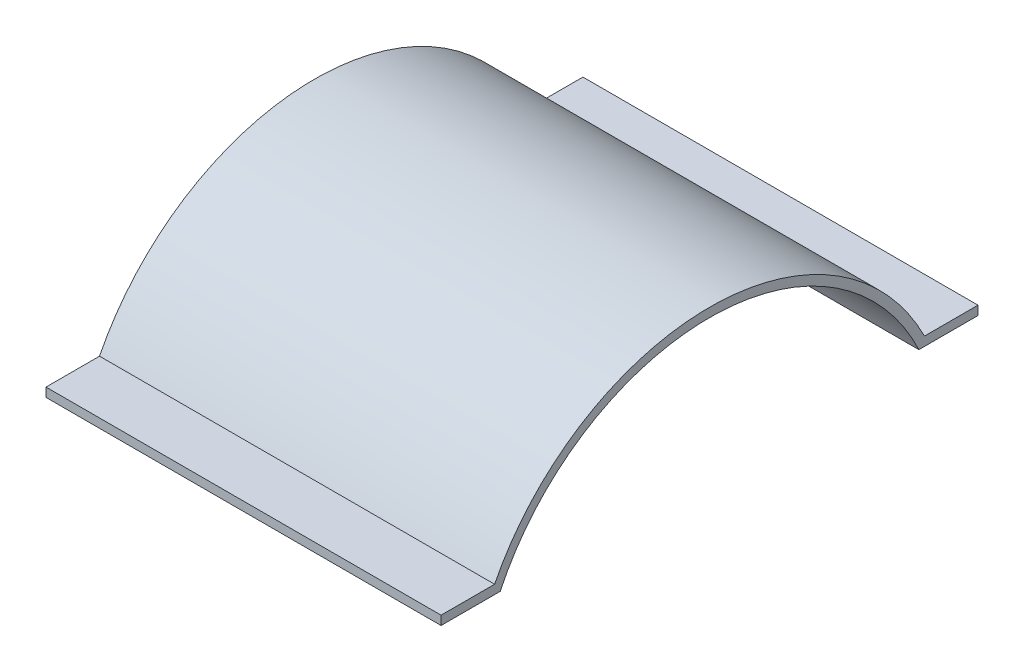
ISO-10303-21;
HEADER;
FILE_DESCRIPTION(('STEP AP214'),'2;1');
FILE_NAME('part.step','',(''),(''),'','','');
FILE_SCHEMA(('AUTOMOTIVE_DESIGN { 1 0 10303 214 1 1 1 1 }'));
ENDSEC;
DATA;
#1=APPLICATION_CONTEXT('core data for automotive mechanical design processes');
#2=APPLICATION_PROTOCOL_DEFINITION('international standard','automotive_design',2000,#1);
#3=PRODUCT_CONTEXT('',#1,'mechanical');
#4=PRODUCT('Part','Part','',(#3));
#5=PRODUCT_RELATED_PRODUCT_CATEGORY('part','',(#4));
#6=PRODUCT_DEFINITION_FORMATION('','',#4);
#7=PRODUCT_DEFINITION_CONTEXT('part definition',#1,'design');
#8=PRODUCT_DEFINITION('design','',#6,#7);
#9=PRODUCT_DEFINITION_SHAPE('','',#8);
#10=(LENGTH_UNIT() NAMED_UNIT(*) SI_UNIT(.MILLI.,.METRE.));
#11=(NAMED_UNIT(*) PLANE_ANGLE_UNIT() SI_UNIT($,.RADIAN.));
#12=(NAMED_UNIT(*) SI_UNIT($,.STERADIAN.) SOLID_ANGLE_UNIT());
#13=UNCERTAINTY_MEASURE_WITH_UNIT(LENGTH_MEASURE(1.E-05),#10,'distance_accuracy_value','');
#14=(GEOMETRIC_REPRESENTATION_CONTEXT(3) GLOBAL_UNCERTAINTY_ASSIGNED_CONTEXT((#13)) GLOBAL_UNIT_ASSIGNED_CONTEXT((#10,
#11,#12)) REPRESENTATION_CONTEXT('',''));
#15=CARTESIAN_POINT('',(0.,0.,0.));
#16=DIRECTION('',(0.,0.,1.));
#17=DIRECTION('',(1.,0.,0.));
#18=AXIS2_PLACEMENT_3D('',#15,#16,#17);
#19=CARTESIAN_POINT('',(44.,-11.05,0.779280478595436));
#20=DIRECTION('',(-1.,0.,0.));
#21=DIRECTION('',(0.,0.,1.));
#22=AXIS2_PLACEMENT_3D('',#19,#20,#21);
#23=CYLINDRICAL_SURFACE('',#22,25.8);
#24=CARTESIAN_POINT('',(0.,-11.05,0.779280478595436));
#25=DIRECTION('',(1.,0.,0.));
#26=DIRECTION('',(0.,0.,-1.));
#27=AXIS2_PLACEMENT_3D('',#24,#25,#26);
#28=CIRCLE('',#27,25.8);
#29=CARTESIAN_POINT('',(0.,0.,-22.5346102305934));
#30=VERTEX_POINT('',#29);
#31=CARTESIAN_POINT('',(0.,0.,24.0931711877842));
#32=VERTEX_POINT('',#31);
#33=EDGE_CURVE('E133',#30,#32,#28,.T.);
#34=ORIENTED_EDGE('',*,*,#33,.F.);
#35=DIRECTION('',(-1.,0.,0.));
#36=VECTOR('',#35,1.);
#37=CARTESIAN_POINT('',(44.,0.,-22.5346102305934));
#38=LINE('',#37,#36);
#39=CARTESIAN_POINT('',(44.,0.,-22.5346102305934));
#40=VERTEX_POINT('',#39);
#41=EDGE_CURVE('E11',#40,#30,#38,.T.);
#42=ORIENTED_EDGE('',*,*,#41,.F.);
#43=CARTESIAN_POINT('',(44.,-11.05,0.779280478595436));
#44=DIRECTION('',(1.,0.,0.));
#45=DIRECTION('',(0.,0.,-1.));
#46=AXIS2_PLACEMENT_3D('',#43,#44,#45);
#47=CIRCLE('',#46,25.8);
#48=CARTESIAN_POINT('',(44.,0.,24.0931711877842));
#49=VERTEX_POINT('',#48);
#50=EDGE_CURVE('E153',#40,#49,#47,.T.);
#51=ORIENTED_EDGE('',*,*,#50,.T.);
#52=DIRECTION('',(-1.,0.,0.));
#53=VECTOR('',#52,1.);
#54=CARTESIAN_POINT('',(44.,0.,24.0931711877842));
#55=LINE('',#54,#53);
#56=EDGE_CURVE('E55',#49,#32,#55,.T.);
#57=ORIENTED_EDGE('',*,*,#56,.T.);
#58=EDGE_LOOP('',(#34,#42,#51,#57));
#59=FACE_BOUND('',#58,.T.);
#60=ADVANCED_FACE('F39',(#59),#23,.F.);
#61=CARTESIAN_POINT('',(44.,0.,0.));
#62=DIRECTION('',(0.,1.,0.));
#63=DIRECTION('',(0.,0.,1.));
#64=AXIS2_PLACEMENT_3D('',#61,#62,#63);
#65=PLANE('',#64);
#66=DIRECTION('',(0.,0.,-1.));
#67=VECTOR('',#66,1.);
#68=CARTESIAN_POINT('',(0.,0.,0.));
#69=LINE('',#68,#67);
#70=CARTESIAN_POINT('',(0.,0.,-29.1207195214046));
#71=VERTEX_POINT('',#70);
#72=EDGE_CURVE('E135',#30,#71,#69,.T.);
#73=ORIENTED_EDGE('',*,*,#72,.T.);
#74=DIRECTION('',(-1.,0.,0.));
#75=VECTOR('',#74,1.);
#76=CARTESIAN_POINT('',(44.,0.,-29.1207195214046));
#77=LINE('',#76,#75);
#78=CARTESIAN_POINT('',(44.,0.,-29.1207195214046));
#79=VERTEX_POINT('',#78);
#80=EDGE_CURVE('E47',#79,#71,#77,.T.);
#81=ORIENTED_EDGE('',*,*,#80,.F.);
#82=DIRECTION('',(0.,0.,-1.));
#83=VECTOR('',#82,1.);
#84=CARTESIAN_POINT('',(44.,0.,0.));
#85=LINE('',#84,#83);
#86=EDGE_CURVE('E178',#40,#79,#85,.T.);
#87=ORIENTED_EDGE('',*,*,#86,.F.);
#88=ORIENTED_EDGE('',*,*,#41,.T.);
#89=EDGE_LOOP('',(#73,#81,#87,#88));
#90=FACE_BOUND('',#89,.T.);
#91=ADVANCED_FACE('F169',(#90),#65,.F.);
#92=CARTESIAN_POINT('',(44.,0.,-29.1207195214046));
#93=DIRECTION('',(0.,0.,-1.));
#94=DIRECTION('',(-1.,0.,0.));
#95=AXIS2_PLACEMENT_3D('',#92,#93,#94);
#96=PLANE('',#95);
#97=DIRECTION('',(0.,-1.,0.));
#98=VECTOR('',#97,1.);
#99=CARTESIAN_POINT('',(0.,0.,-29.1207195214046));
#100=LINE('',#99,#98);
#101=CARTESIAN_POINT('',(0.,1.,-29.1207195214046));
#102=VERTEX_POINT('',#101);
#103=EDGE_CURVE('E138',#102,#71,#100,.T.);
#104=ORIENTED_EDGE('',*,*,#103,.F.);
#105=DIRECTION('',(-1.,0.,0.));
#106=VECTOR('',#105,1.);
#107=CARTESIAN_POINT('',(44.,1.,-29.1207195214046));
#108=LINE('',#107,#106);
#109=CARTESIAN_POINT('',(44.,1.,-29.1207195214046));
#110=VERTEX_POINT('',#109);
#111=EDGE_CURVE('E159',#110,#102,#108,.T.);
#112=ORIENTED_EDGE('',*,*,#111,.F.);
#113=DIRECTION('',(0.,-1.,0.));
#114=VECTOR('',#113,1.);
#115=CARTESIAN_POINT('',(44.,0.,-29.1207195214046));
#116=LINE('',#115,#114);
#117=EDGE_CURVE('E166',#110,#79,#116,.T.);
#118=ORIENTED_EDGE('',*,*,#117,.T.);
#119=ORIENTED_EDGE('',*,*,#80,.T.);
#120=EDGE_LOOP('',(#104,#112,#118,#119));
#121=FACE_BOUND('',#120,.T.);
#122=ADVANCED_FACE('F164',(#121),#96,.T.);
#123=CARTESIAN_POINT('',(44.,1.,0.));
#124=DIRECTION('',(0.,1.,0.));
#125=DIRECTION('',(0.,0.,1.));
#126=AXIS2_PLACEMENT_3D('',#123,#124,#125);
#127=PLANE('',#126);
#128=DIRECTION('',(0.,0.,-1.));
#129=VECTOR('',#128,1.);
#130=CARTESIAN_POINT('',(0.,1.,0.));
#131=LINE('',#130,#129);
#132=CARTESIAN_POINT('',(0.,1.,-23.1589212082481));
#133=VERTEX_POINT('',#132);
#134=EDGE_CURVE('E141',#133,#102,#131,.T.);
#135=ORIENTED_EDGE('',*,*,#134,.F.);
#136=DIRECTION('',(-1.,0.,0.));
#137=VECTOR('',#136,1.);
#138=CARTESIAN_POINT('',(44.,1.,-23.1589212082481));
#139=LINE('',#138,#137);
#140=CARTESIAN_POINT('',(44.,1.,-23.1589212082481));
#141=VERTEX_POINT('',#140);
#142=EDGE_CURVE('E157',#141,#133,#139,.T.);
#143=ORIENTED_EDGE('',*,*,#142,.F.);
#144=DIRECTION('',(0.,0.,-1.));
#145=VECTOR('',#144,1.);
#146=CARTESIAN_POINT('',(44.,1.,0.));
#147=LINE('',#146,#145);
#148=EDGE_CURVE('E177',#141,#110,#147,.T.);
#149=ORIENTED_EDGE('',*,*,#148,.T.);
#150=ORIENTED_EDGE('',*,*,#111,.T.);
#151=EDGE_LOOP('',(#135,#143,#149,#150));
#152=FACE_BOUND('',#151,.T.);
#153=ADVANCED_FACE('F175',(#152),#127,.T.);
#154=CARTESIAN_POINT('',(44.,-11.05,0.779280478595436));
#155=DIRECTION('',(-1.,0.,0.));
#156=DIRECTION('',(0.,0.,1.));
#157=AXIS2_PLACEMENT_3D('',#154,#155,#156);
#158=CYLINDRICAL_SURFACE('',#157,26.8);
#159=CARTESIAN_POINT('',(0.,-11.05,0.779280478595436));
#160=DIRECTION('',(1.,0.,0.));
#161=DIRECTION('',(0.,0.,-1.));
#162=AXIS2_PLACEMENT_3D('',#159,#160,#161);
#163=CIRCLE('',#162,26.8);
#164=CARTESIAN_POINT('',(0.,1.,24.717482165439));
#165=VERTEX_POINT('',#164);
#166=EDGE_CURVE('E144',#133,#165,#163,.T.);
#167=ORIENTED_EDGE('',*,*,#166,.T.);
#168=DIRECTION('',(-1.,0.,0.));
#169=VECTOR('',#168,1.);
#170=CARTESIAN_POINT('',(44.,1.,24.717482165439));
#171=LINE('',#170,#169);
#172=CARTESIAN_POINT('',(44.,1.,24.717482165439));
#173=VERTEX_POINT('',#172);
#174=EDGE_CURVE('E114',#173,#165,#171,.T.);
#175=ORIENTED_EDGE('',*,*,#174,.F.);
#176=CARTESIAN_POINT('',(44.,-11.05,0.779280478595436));
#177=DIRECTION('',(1.,0.,0.));
#178=DIRECTION('',(0.,0.,-1.));
#179=AXIS2_PLACEMENT_3D('',#176,#177,#178);
#180=CIRCLE('',#179,26.8);
#181=EDGE_CURVE('E124',#141,#173,#180,.T.);
#182=ORIENTED_EDGE('',*,*,#181,.F.);
#183=ORIENTED_EDGE('',*,*,#142,.T.);
#184=EDGE_LOOP('',(#167,#175,#182,#183));
#185=FACE_BOUND('',#184,.T.);
#186=ADVANCED_FACE('F204',(#185),#158,.T.);
#187=CARTESIAN_POINT('',(44.,1.,0.));
#188=DIRECTION('',(0.,1.,0.));
#189=DIRECTION('',(0.,0.,1.));
#190=AXIS2_PLACEMENT_3D('',#187,#188,#189);
#191=PLANE('',#190);
#192=DIRECTION('',(0.,0.,-1.));
#193=VECTOR('',#192,1.);
#194=CARTESIAN_POINT('',(0.,1.,0.));
#195=LINE('',#194,#193);
#196=CARTESIAN_POINT('',(0.,1.,30.6792804785954));
#197=VERTEX_POINT('',#196);
#198=EDGE_CURVE('E110',#197,#165,#195,.T.);
#199=ORIENTED_EDGE('',*,*,#198,.F.);
#200=DIRECTION('',(-1.,0.,0.));
#201=VECTOR('',#200,1.);
#202=CARTESIAN_POINT('',(44.,1.,30.6792804785954));
#203=LINE('',#202,#201);
#204=CARTESIAN_POINT('',(44.,1.,30.6792804785954));
#205=VERTEX_POINT('',#204);
#206=EDGE_CURVE('E105',#205,#197,#203,.T.);
#207=ORIENTED_EDGE('',*,*,#206,.F.);
#208=DIRECTION('',(0.,0.,-1.));
#209=VECTOR('',#208,1.);
#210=CARTESIAN_POINT('',(44.,1.,0.));
#211=LINE('',#210,#209);
#212=EDGE_CURVE('E108',#205,#173,#211,.T.);
#213=ORIENTED_EDGE('',*,*,#212,.T.);
#214=ORIENTED_EDGE('',*,*,#174,.T.);
#215=EDGE_LOOP('',(#199,#207,#213,#214));
#216=FACE_BOUND('',#215,.T.);
#217=ADVANCED_FACE('F107',(#216),#191,.T.);
#218=CARTESIAN_POINT('',(44.,-1.06440136144593E-13,30.6792804785954));
#219=DIRECTION('',(0.,0.,1.));
#220=DIRECTION('',(0.,-1.,0.));
#221=AXIS2_PLACEMENT_3D('',#218,#219,#220);
#222=PLANE('',#221);
#223=DIRECTION('',(0.,1.,0.));
#224=VECTOR('',#223,1.);
#225=CARTESIAN_POINT('',(0.,-1.06440136144593E-13,30.6792804785954));
#226=LINE('',#225,#224);
#227=CARTESIAN_POINT('',(0.,0.,30.6792804785954));
#228=VERTEX_POINT('',#227);
#229=EDGE_CURVE('E148',#228,#197,#226,.T.);
#230=ORIENTED_EDGE('',*,*,#229,.F.);
#231=DIRECTION('',(-1.,0.,0.));
#232=VECTOR('',#231,1.);
#233=CARTESIAN_POINT('',(44.,0.,30.6792804785954));
#234=LINE('',#233,#232);
#235=CARTESIAN_POINT('',(44.,0.,30.6792804785954));
#236=VERTEX_POINT('',#235);
#237=EDGE_CURVE('E80',#236,#228,#234,.T.);
#238=ORIENTED_EDGE('',*,*,#237,.F.);
#239=DIRECTION('',(0.,1.,0.));
#240=VECTOR('',#239,1.);
#241=CARTESIAN_POINT('',(44.,-1.06440136144593E-13,30.6792804785954));
#242=LINE('',#241,#240);
#243=EDGE_CURVE('E121',#236,#205,#242,.T.);
#244=ORIENTED_EDGE('',*,*,#243,.T.);
#245=ORIENTED_EDGE('',*,*,#206,.T.);
#246=EDGE_LOOP('',(#230,#238,#244,#245));
#247=FACE_BOUND('',#246,.T.);
#248=ADVANCED_FACE('F127',(#247),#222,.T.);
#249=CARTESIAN_POINT('',(44.,0.,0.));
#250=DIRECTION('',(0.,-1.,0.));
#251=DIRECTION('',(0.,0.,-1.));
#252=AXIS2_PLACEMENT_3D('',#249,#250,#251);
#253=PLANE('',#252);
#254=DIRECTION('',(0.,0.,1.));
#255=VECTOR('',#254,1.);
#256=CARTESIAN_POINT('',(0.,0.,0.));
#257=LINE('',#256,#255);
#258=EDGE_CURVE('E150',#32,#228,#257,.T.);
#259=ORIENTED_EDGE('',*,*,#258,.F.);
#260=ORIENTED_EDGE('',*,*,#56,.F.);
#261=DIRECTION('',(0.,0.,1.));
#262=VECTOR('',#261,1.);
#263=CARTESIAN_POINT('',(44.,0.,0.));
#264=LINE('',#263,#262);
#265=EDGE_CURVE('E128',#49,#236,#264,.T.);
#266=ORIENTED_EDGE('',*,*,#265,.T.);
#267=ORIENTED_EDGE('',*,*,#237,.T.);
#268=EDGE_LOOP('',(#259,#260,#266,#267));
#269=FACE_BOUND('',#268,.T.);
#270=ADVANCED_FACE('F183',(#269),#253,.T.);
#271=CARTESIAN_POINT('',(44.,0.,0.));
#272=DIRECTION('',(1.,0.,0.));
#273=DIRECTION('',(0.,0.,-1.));
#274=AXIS2_PLACEMENT_3D('',#271,#272,#273);
#275=PLANE('',#274);
#276=ORIENTED_EDGE('',*,*,#50,.F.);
#277=ORIENTED_EDGE('',*,*,#86,.T.);
#278=ORIENTED_EDGE('',*,*,#117,.F.);
#279=ORIENTED_EDGE('',*,*,#148,.F.);
#280=ORIENTED_EDGE('',*,*,#181,.T.);
#281=ORIENTED_EDGE('',*,*,#212,.F.);
#282=ORIENTED_EDGE('',*,*,#243,.F.);
#283=ORIENTED_EDGE('',*,*,#265,.F.);
#284=EDGE_LOOP('',(#276,#277,#278,#279,#280,#281,#282,#283));
#285=FACE_BOUND('',#284,.T.);
#286=ADVANCED_FACE('F119',(#285),#275,.T.);
#287=CARTESIAN_POINT('',(0.,0.,0.));
#288=DIRECTION('',(1.,0.,0.));
#289=DIRECTION('',(0.,0.,-1.));
#290=AXIS2_PLACEMENT_3D('',#287,#288,#289);
#291=PLANE('',#290);
#292=ORIENTED_EDGE('',*,*,#33,.T.);
#293=ORIENTED_EDGE('',*,*,#258,.T.);
#294=ORIENTED_EDGE('',*,*,#229,.T.);
#295=ORIENTED_EDGE('',*,*,#198,.T.);
#296=ORIENTED_EDGE('',*,*,#166,.F.);
#297=ORIENTED_EDGE('',*,*,#134,.T.);
#298=ORIENTED_EDGE('',*,*,#103,.T.);
#299=ORIENTED_EDGE('',*,*,#72,.F.);
#300=EDGE_LOOP('',(#292,#293,#294,#295,#296,#297,#298,#299));
#301=FACE_BOUND('',#300,.T.);
#302=ADVANCED_FACE('F171',(#301),#291,.F.);
#303=CLOSED_SHELL('',(#60,#91,#122,#153,#186,#217,#248,#270,#286,#302));
#304=MANIFOLD_SOLID_BREP('B2',#303);
#305=ADVANCED_BREP_SHAPE_REPRESENTATION('',(#18,#304),#14);
#306=SHAPE_DEFINITION_REPRESENTATION(#9,#305);
ENDSEC;
END-ISO-10303-21;
